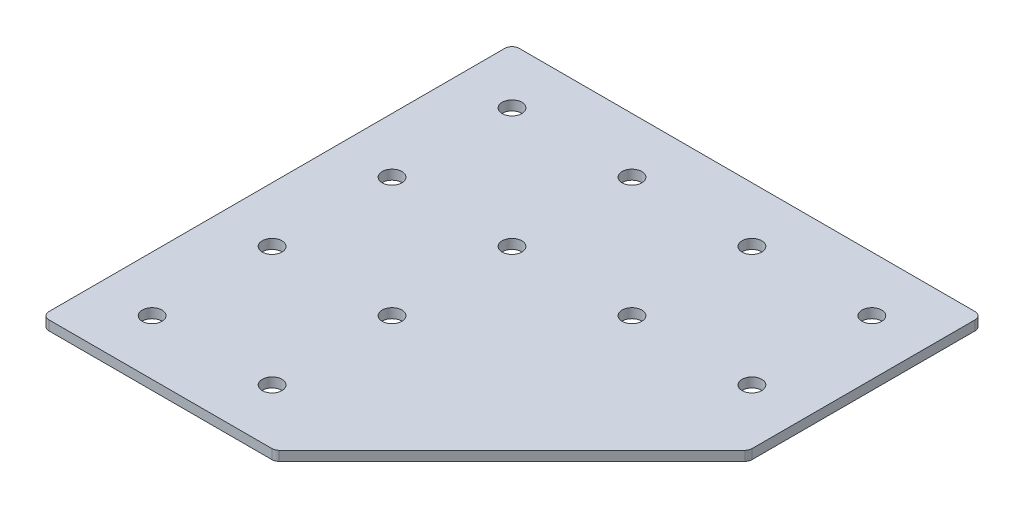
ISO-10303-21;
HEADER;
FILE_DESCRIPTION(('STEP AP214'),'2;1');
FILE_NAME('part.step','',(''),(''),'','','');
FILE_SCHEMA(('AUTOMOTIVE_DESIGN { 1 0 10303 214 1 1 1 1 }'));
ENDSEC;
DATA;
#1=APPLICATION_CONTEXT('core data for automotive mechanical design processes');
#2=APPLICATION_PROTOCOL_DEFINITION('international standard','automotive_design',2000,#1);
#3=PRODUCT_CONTEXT('',#1,'mechanical');
#4=PRODUCT('Part','Part','',(#3));
#5=PRODUCT_RELATED_PRODUCT_CATEGORY('part','',(#4));
#6=PRODUCT_DEFINITION_FORMATION('','',#4);
#7=PRODUCT_DEFINITION_CONTEXT('part definition',#1,'design');
#8=PRODUCT_DEFINITION('design','',#6,#7);
#9=PRODUCT_DEFINITION_SHAPE('','',#8);
#10=(LENGTH_UNIT() NAMED_UNIT(*) SI_UNIT(.MILLI.,.METRE.));
#11=(NAMED_UNIT(*) PLANE_ANGLE_UNIT() SI_UNIT($,.RADIAN.));
#12=(NAMED_UNIT(*) SI_UNIT($,.STERADIAN.) SOLID_ANGLE_UNIT());
#13=UNCERTAINTY_MEASURE_WITH_UNIT(LENGTH_MEASURE(1.E-05),#10,'distance_accuracy_value','');
#14=(GEOMETRIC_REPRESENTATION_CONTEXT(3) GLOBAL_UNCERTAINTY_ASSIGNED_CONTEXT((#13)) GLOBAL_UNIT_ASSIGNED_CONTEXT((#10,
#11,#12)) REPRESENTATION_CONTEXT('',''));
#15=CARTESIAN_POINT('',(0.,0.,0.));
#16=DIRECTION('',(0.,0.,1.));
#17=DIRECTION('',(1.,0.,0.));
#18=AXIS2_PLACEMENT_3D('',#15,#16,#17);
#19=CARTESIAN_POINT('',(-51.3742099073396,0.924626277206244,-51.5499410746997));
#20=DIRECTION('',(0.,-1.,0.));
#21=DIRECTION('',(0.,0.,-1.));
#22=AXIS2_PLACEMENT_3D('',#19,#20,#21);
#23=PLANE('',#22);
#24=CARTESIAN_POINT('',(73.6257900926604,0.924626277206244,-26.5499410746997));
#25=DIRECTION('',(0.,1.,0.));
#26=DIRECTION('',(0.,0.,1.));
#27=AXIS2_PLACEMENT_3D('',#24,#25,#26);
#28=CIRCLE('',#27,4.1);
#29=CARTESIAN_POINT('',(73.6257900926604,0.924626277206244,-22.4499410746997));
#30=VERTEX_POINT('',#29);
#31=EDGE_CURVE('E275',#30,#30,#28,.T.);
#32=ORIENTED_EDGE('',*,*,#31,.T.);
#33=EDGE_LOOP('',(#32));
#34=FACE_BOUND('',#33,.T.);
#35=CARTESIAN_POINT('',(23.6257900926604,0.924626277206244,-26.5499410746997));
#36=DIRECTION('',(0.,1.,0.));
#37=DIRECTION('',(0.,0.,1.));
#38=AXIS2_PLACEMENT_3D('',#35,#36,#37);
#39=CIRCLE('',#38,4.09999999999999);
#40=CARTESIAN_POINT('',(23.6257900926604,0.924626277206244,-22.4499410746997));
#41=VERTEX_POINT('',#40);
#42=EDGE_CURVE('E283',#41,#41,#39,.T.);
#43=ORIENTED_EDGE('',*,*,#42,.T.);
#44=EDGE_LOOP('',(#43));
#45=FACE_BOUND('',#44,.T.);
#46=CARTESIAN_POINT('',(-26.3742099073396,0.924626277206244,73.4500589253003));
#47=DIRECTION('',(0.,1.,0.));
#48=DIRECTION('',(0.,0.,1.));
#49=AXIS2_PLACEMENT_3D('',#46,#47,#48);
#50=CIRCLE('',#49,4.10000000000001);
#51=CARTESIAN_POINT('',(-26.3742099073396,0.924626277206244,77.5500589253003));
#52=VERTEX_POINT('',#51);
#53=EDGE_CURVE('E289',#52,#52,#50,.T.);
#54=ORIENTED_EDGE('',*,*,#53,.T.);
#55=EDGE_LOOP('',(#54));
#56=FACE_BOUND('',#55,.T.);
#57=CARTESIAN_POINT('',(-76.3742099073396,0.924626277206244,73.4500589253003));
#58=DIRECTION('',(0.,1.,0.));
#59=DIRECTION('',(0.,0.,1.));
#60=AXIS2_PLACEMENT_3D('',#57,#58,#59);
#61=CIRCLE('',#60,4.10000000000001);
#62=CARTESIAN_POINT('',(-76.3742099073396,0.924626277206244,77.5500589253003));
#63=VERTEX_POINT('',#62);
#64=EDGE_CURVE('E295',#63,#63,#61,.T.);
#65=ORIENTED_EDGE('',*,*,#64,.T.);
#66=EDGE_LOOP('',(#65));
#67=FACE_BOUND('',#66,.T.);
#68=CARTESIAN_POINT('',(-26.3742099073396,0.924626277206244,23.4500589253003));
#69=DIRECTION('',(0.,1.,0.));
#70=DIRECTION('',(0.,0.,1.));
#71=AXIS2_PLACEMENT_3D('',#68,#69,#70);
#72=CIRCLE('',#71,4.10000000000001);
#73=CARTESIAN_POINT('',(-26.3742099073396,0.924626277206244,27.5500589253003));
#74=VERTEX_POINT('',#73);
#75=EDGE_CURVE('E301',#74,#74,#72,.T.);
#76=ORIENTED_EDGE('',*,*,#75,.T.);
#77=EDGE_LOOP('',(#76));
#78=FACE_BOUND('',#77,.T.);
#79=CARTESIAN_POINT('',(-76.3742099073396,0.924626277206244,23.4500589253003));
#80=DIRECTION('',(0.,1.,0.));
#81=DIRECTION('',(0.,0.,1.));
#82=AXIS2_PLACEMENT_3D('',#79,#80,#81);
#83=CIRCLE('',#82,4.10000000000001);
#84=CARTESIAN_POINT('',(-76.3742099073396,0.924626277206244,27.5500589253003));
#85=VERTEX_POINT('',#84);
#86=EDGE_CURVE('E307',#85,#85,#83,.T.);
#87=ORIENTED_EDGE('',*,*,#86,.T.);
#88=EDGE_LOOP('',(#87));
#89=FACE_BOUND('',#88,.T.);
#90=CARTESIAN_POINT('',(-26.3742099073396,0.924626277206244,-26.5499410746997));
#91=DIRECTION('',(0.,1.,0.));
#92=DIRECTION('',(0.,0.,1.));
#93=AXIS2_PLACEMENT_3D('',#90,#91,#92);
#94=CIRCLE('',#93,4.1);
#95=CARTESIAN_POINT('',(-26.3742099073396,0.924626277206244,-22.4499410746997));
#96=VERTEX_POINT('',#95);
#97=EDGE_CURVE('E313',#96,#96,#94,.T.);
#98=ORIENTED_EDGE('',*,*,#97,.T.);
#99=EDGE_LOOP('',(#98));
#100=FACE_BOUND('',#99,.T.);
#101=CARTESIAN_POINT('',(-76.3742099073396,0.924626277206244,-26.5499410746997));
#102=DIRECTION('',(0.,1.,0.));
#103=DIRECTION('',(0.,0.,1.));
#104=AXIS2_PLACEMENT_3D('',#101,#102,#103);
#105=CIRCLE('',#104,4.1);
#106=CARTESIAN_POINT('',(-76.3742099073396,0.924626277206244,-22.4499410746997));
#107=VERTEX_POINT('',#106);
#108=EDGE_CURVE('E319',#107,#107,#105,.T.);
#109=ORIENTED_EDGE('',*,*,#108,.T.);
#110=EDGE_LOOP('',(#109));
#111=FACE_BOUND('',#110,.T.);
#112=CARTESIAN_POINT('',(73.6257900926604,0.924626277206244,-76.5499410746997));
#113=DIRECTION('',(0.,1.,0.));
#114=DIRECTION('',(0.,0.,1.));
#115=AXIS2_PLACEMENT_3D('',#112,#113,#114);
#116=CIRCLE('',#115,4.09999999999999);
#117=CARTESIAN_POINT('',(73.6257900926604,0.924626277206244,-72.4499410746997));
#118=VERTEX_POINT('',#117);
#119=EDGE_CURVE('E325',#118,#118,#116,.T.);
#120=ORIENTED_EDGE('',*,*,#119,.T.);
#121=EDGE_LOOP('',(#120));
#122=FACE_BOUND('',#121,.T.);
#123=CARTESIAN_POINT('',(23.6257900926604,0.924626277206244,-76.5499410746997));
#124=DIRECTION('',(0.,1.,0.));
#125=DIRECTION('',(0.,0.,1.));
#126=AXIS2_PLACEMENT_3D('',#123,#124,#125);
#127=CIRCLE('',#126,4.09999999999999);
#128=CARTESIAN_POINT('',(23.6257900926604,0.924626277206244,-72.4499410746997));
#129=VERTEX_POINT('',#128);
#130=EDGE_CURVE('E331',#129,#129,#127,.T.);
#131=ORIENTED_EDGE('',*,*,#130,.T.);
#132=EDGE_LOOP('',(#131));
#133=FACE_BOUND('',#132,.T.);
#134=CARTESIAN_POINT('',(-26.3742099073396,0.924626277206244,-76.5499410746997));
#135=DIRECTION('',(0.,1.,0.));
#136=DIRECTION('',(0.,0.,1.));
#137=AXIS2_PLACEMENT_3D('',#134,#135,#136);
#138=CIRCLE('',#137,4.1);
#139=CARTESIAN_POINT('',(-26.3742099073396,0.924626277206244,-72.4499410746997));
#140=VERTEX_POINT('',#139);
#141=EDGE_CURVE('E337',#140,#140,#138,.T.);
#142=ORIENTED_EDGE('',*,*,#141,.T.);
#143=EDGE_LOOP('',(#142));
#144=FACE_BOUND('',#143,.T.);
#145=CARTESIAN_POINT('',(-76.3742099073396,0.924626277206244,-76.5499410746997));
#146=DIRECTION('',(0.,1.,0.));
#147=DIRECTION('',(0.,0.,1.));
#148=AXIS2_PLACEMENT_3D('',#145,#146,#147);
#149=CIRCLE('',#148,4.1);
#150=CARTESIAN_POINT('',(-76.3742099073396,0.924626277206244,-72.4499410746997));
#151=VERTEX_POINT('',#150);
#152=EDGE_CURVE('E175',#151,#151,#149,.T.);
#153=ORIENTED_EDGE('',*,*,#152,.T.);
#154=EDGE_LOOP('',(#153));
#155=FACE_BOUND('',#154,.T.);
#156=DIRECTION('',(1.,0.,0.));
#157=VECTOR('',#156,1.);
#158=CARTESIAN_POINT('',(-99.3742099073397,0.924626277206244,96.4500589253003));
#159=LINE('',#158,#157);
#160=CARTESIAN_POINT('',(-96.3742099073397,0.924626277206244,96.4500589253003));
#161=VERTEX_POINT('',#160);
#162=CARTESIAN_POINT('',(-3.44527771920494,0.924626277206244,96.4500589253002));
#163=VERTEX_POINT('',#162);
#164=EDGE_CURVE('E121',#161,#163,#159,.T.);
#165=ORIENTED_EDGE('',*,*,#164,.F.);
#166=CARTESIAN_POINT('',(-96.3742099073397,0.924626277206244,93.4500589253003));
#167=DIRECTION('',(0.,-1.,0.));
#168=DIRECTION('',(0.,0.,-1.));
#169=AXIS2_PLACEMENT_3D('',#166,#167,#168);
#170=CIRCLE('',#169,3.);
#171=CARTESIAN_POINT('',(-99.3742099073397,0.924626277206244,93.4500589253003));
#172=VERTEX_POINT('',#171);
#173=EDGE_CURVE('E145',#161,#172,#170,.T.);
#174=ORIENTED_EDGE('',*,*,#173,.T.);
#175=DIRECTION('',(0.,0.,1.));
#176=VECTOR('',#175,1.);
#177=CARTESIAN_POINT('',(-99.3742099073397,0.924626277206244,-99.5499410746997));
#178=LINE('',#177,#176);
#179=CARTESIAN_POINT('',(-99.3742099073397,0.924626277206244,-96.5499410746997));
#180=VERTEX_POINT('',#179);
#181=EDGE_CURVE('E162',#180,#172,#178,.T.);
#182=ORIENTED_EDGE('',*,*,#181,.F.);
#183=CARTESIAN_POINT('',(-96.3742099073397,0.924626277206244,-96.5499410746997));
#184=DIRECTION('',(0.,-1.,0.));
#185=DIRECTION('',(0.,0.,-1.));
#186=AXIS2_PLACEMENT_3D('',#183,#184,#185);
#187=CIRCLE('',#186,3.);
#188=CARTESIAN_POINT('',(-96.3742099073397,0.924626277206244,-99.5499410746997));
#189=VERTEX_POINT('',#188);
#190=EDGE_CURVE('E117',#180,#189,#187,.T.);
#191=ORIENTED_EDGE('',*,*,#190,.T.);
#192=DIRECTION('',(-1.,0.,0.));
#193=VECTOR('',#192,1.);
#194=CARTESIAN_POINT('',(96.6257900926603,0.924626277206244,-99.5499410746997));
#195=LINE('',#194,#193);
#196=CARTESIAN_POINT('',(93.6257900926603,0.924626277206244,-99.5499410746997));
#197=VERTEX_POINT('',#196);
#198=EDGE_CURVE('E160',#197,#189,#195,.T.);
#199=ORIENTED_EDGE('',*,*,#198,.F.);
#200=CARTESIAN_POINT('',(93.6257900926603,0.924626277206244,-96.5499410746998));
#201=DIRECTION('',(0.,-1.,0.));
#202=DIRECTION('',(0.,0.,-1.));
#203=AXIS2_PLACEMENT_3D('',#200,#201,#202);
#204=CIRCLE('',#203,3.);
#205=CARTESIAN_POINT('',(96.6257900926603,0.924626277206244,-96.5499410746997));
#206=VERTEX_POINT('',#205);
#207=EDGE_CURVE('E140',#197,#206,#204,.T.);
#208=ORIENTED_EDGE('',*,*,#207,.T.);
#209=DIRECTION('',(0.,0.,-1.));
#210=VECTOR('',#209,1.);
#211=CARTESIAN_POINT('',(96.6257900926603,0.924626277206244,-2.3783681994458));
#212=LINE('',#211,#210);
#213=CARTESIAN_POINT('',(96.6257900926603,0.924626277206244,-3.62100888656507));
#214=VERTEX_POINT('',#213);
#215=EDGE_CURVE('E163',#214,#206,#212,.T.);
#216=ORIENTED_EDGE('',*,*,#215,.F.);
#217=CARTESIAN_POINT('',(93.6257900926603,0.924626277206244,-3.62100888656507));
#218=DIRECTION('',(0.,-1.,0.));
#219=DIRECTION('',(0.,0.,-1.));
#220=AXIS2_PLACEMENT_3D('',#217,#218,#219);
#221=CIRCLE('',#220,3.);
#222=CARTESIAN_POINT('',(95.7471104362199,0.924626277206244,-1.49968854300543));
#223=VERTEX_POINT('',#222);
#224=EDGE_CURVE('E31',#214,#223,#221,.T.);
#225=ORIENTED_EDGE('',*,*,#224,.T.);
#226=DIRECTION('',(0.707106781186547,0.,-0.707106781186548));
#227=VECTOR('',#226,1.);
#228=CARTESIAN_POINT('',(-2.20263703208567,0.924626277206244,96.4500589253002));
#229=LINE('',#228,#227);
#230=CARTESIAN_POINT('',(-1.3239573756453,0.924626277206244,95.5713792688599));
#231=VERTEX_POINT('',#230);
#232=EDGE_CURVE('E118',#231,#223,#229,.T.);
#233=ORIENTED_EDGE('',*,*,#232,.F.);
#234=CARTESIAN_POINT('',(-3.44527771920494,0.924626277206244,93.4500589253002));
#235=DIRECTION('',(0.,-1.,0.));
#236=DIRECTION('',(0.,0.,-1.));
#237=AXIS2_PLACEMENT_3D('',#234,#235,#236);
#238=CIRCLE('',#237,3.);
#239=EDGE_CURVE('E143',#231,#163,#238,.T.);
#240=ORIENTED_EDGE('',*,*,#239,.T.);
#241=EDGE_LOOP('',(#165,#174,#182,#191,#199,#208,#216,#225,#233,#240));
#242=FACE_BOUND('',#241,.T.);
#243=ADVANCED_FACE('F16',(#34,#45,#56,#67,#78,#89,#100,#111,#122,#133,#144,#155,#242),#23,.T.);
#244=CARTESIAN_POINT('',(96.6257900926603,0.924626277206244,-2.3783681994458));
#245=DIRECTION('',(1.,0.,0.));
#246=DIRECTION('',(0.,0.,-1.));
#247=AXIS2_PLACEMENT_3D('',#244,#245,#246);
#248=PLANE('',#247);
#249=DIRECTION('',(0.,0.,-1.));
#250=VECTOR('',#249,1.);
#251=CARTESIAN_POINT('',(96.6257900926603,4.92462627720624,-2.3783681994458));
#252=LINE('',#251,#250);
#253=CARTESIAN_POINT('',(96.6257900926603,4.92462627720624,-3.62100888656507));
#254=VERTEX_POINT('',#253);
#255=CARTESIAN_POINT('',(96.6257900926603,4.92462627720624,-96.5499410746997));
#256=VERTEX_POINT('',#255);
#257=EDGE_CURVE('E172',#254,#256,#252,.T.);
#258=ORIENTED_EDGE('',*,*,#257,.F.);
#259=DIRECTION('',(0.,1.,0.));
#260=VECTOR('',#259,1.);
#261=CARTESIAN_POINT('',(96.6257900926603,0.924626277206244,-3.62100888656507));
#262=LINE('',#261,#260);
#263=EDGE_CURVE('E154',#254,#214,#262,.F.);
#264=ORIENTED_EDGE('',*,*,#263,.T.);
#265=ORIENTED_EDGE('',*,*,#215,.T.);
#266=DIRECTION('',(0.,1.,0.));
#267=VECTOR('',#266,1.);
#268=CARTESIAN_POINT('',(96.6257900926603,0.924626277206244,-96.5499410746998));
#269=LINE('',#268,#267);
#270=EDGE_CURVE('E151',#206,#256,#269,.T.);
#271=ORIENTED_EDGE('',*,*,#270,.T.);
#272=EDGE_LOOP('',(#258,#264,#265,#271));
#273=FACE_BOUND('',#272,.T.);
#274=ADVANCED_FACE('F206',(#273),#248,.T.);
#275=CARTESIAN_POINT('',(-2.20263703208567,0.924626277206244,96.4500589253002));
#276=DIRECTION('',(0.707106781186548,0.,0.707106781186547));
#277=DIRECTION('',(0.707106781186547,0.,-0.707106781186548));
#278=AXIS2_PLACEMENT_3D('',#275,#276,#277);
#279=PLANE('',#278);
#280=DIRECTION('',(0.707106781186547,0.,-0.707106781186548));
#281=VECTOR('',#280,1.);
#282=CARTESIAN_POINT('',(-2.20263703208567,4.92462627720624,96.4500589253002));
#283=LINE('',#282,#281);
#284=CARTESIAN_POINT('',(-1.3239573756453,4.92462627720624,95.5713792688599));
#285=VERTEX_POINT('',#284);
#286=CARTESIAN_POINT('',(95.7471104362199,4.92462627720624,-1.49968854300543));
#287=VERTEX_POINT('',#286);
#288=EDGE_CURVE('E124',#285,#287,#283,.T.);
#289=ORIENTED_EDGE('',*,*,#288,.F.);
#290=DIRECTION('',(0.,1.,0.));
#291=VECTOR('',#290,1.);
#292=CARTESIAN_POINT('',(-1.3239573756453,0.924626277206244,95.5713792688599));
#293=LINE('',#292,#291);
#294=EDGE_CURVE('E38',#285,#231,#293,.F.);
#295=ORIENTED_EDGE('',*,*,#294,.T.);
#296=ORIENTED_EDGE('',*,*,#232,.T.);
#297=DIRECTION('',(0.,1.,0.));
#298=VECTOR('',#297,1.);
#299=CARTESIAN_POINT('',(95.7471104362199,0.924626277206244,-1.49968854300542));
#300=LINE('',#299,#298);
#301=EDGE_CURVE('E147',#223,#287,#300,.T.);
#302=ORIENTED_EDGE('',*,*,#301,.T.);
#303=EDGE_LOOP('',(#289,#295,#296,#302));
#304=FACE_BOUND('',#303,.T.);
#305=ADVANCED_FACE('F180',(#304),#279,.T.);
#306=CARTESIAN_POINT('',(-99.3742099073397,0.924626277206244,96.4500589253003));
#307=DIRECTION('',(0.,0.,1.));
#308=DIRECTION('',(1.,0.,0.));
#309=AXIS2_PLACEMENT_3D('',#306,#307,#308);
#310=PLANE('',#309);
#311=DIRECTION('',(1.,0.,0.));
#312=VECTOR('',#311,1.);
#313=CARTESIAN_POINT('',(-99.3742099073397,4.92462627720624,96.4500589253003));
#314=LINE('',#313,#312);
#315=CARTESIAN_POINT('',(-96.3742099073397,4.92462627720624,96.4500589253003));
#316=VERTEX_POINT('',#315);
#317=CARTESIAN_POINT('',(-3.44527771920494,4.92462627720624,96.4500589253002));
#318=VERTEX_POINT('',#317);
#319=EDGE_CURVE('E114',#316,#318,#314,.T.);
#320=ORIENTED_EDGE('',*,*,#319,.F.);
#321=DIRECTION('',(0.,1.,0.));
#322=VECTOR('',#321,1.);
#323=CARTESIAN_POINT('',(-96.3742099073397,0.924626277206244,96.4500589253003));
#324=LINE('',#323,#322);
#325=EDGE_CURVE('E137',#316,#161,#324,.F.);
#326=ORIENTED_EDGE('',*,*,#325,.T.);
#327=ORIENTED_EDGE('',*,*,#164,.T.);
#328=DIRECTION('',(0.,1.,0.));
#329=VECTOR('',#328,1.);
#330=CARTESIAN_POINT('',(-3.44527771920494,0.924626277206244,96.4500589253002));
#331=LINE('',#330,#329);
#332=EDGE_CURVE('E134',#163,#318,#331,.T.);
#333=ORIENTED_EDGE('',*,*,#332,.T.);
#334=EDGE_LOOP('',(#320,#326,#327,#333));
#335=FACE_BOUND('',#334,.T.);
#336=ADVANCED_FACE('F189',(#335),#310,.T.);
#337=CARTESIAN_POINT('',(-99.3742099073397,0.924626277206244,-99.5499410746997));
#338=DIRECTION('',(-1.,0.,0.));
#339=DIRECTION('',(0.,0.,1.));
#340=AXIS2_PLACEMENT_3D('',#337,#338,#339);
#341=PLANE('',#340);
#342=ORIENTED_EDGE('',*,*,#181,.T.);
#343=DIRECTION('',(0.,1.,0.));
#344=VECTOR('',#343,1.);
#345=CARTESIAN_POINT('',(-99.3742099073397,0.924626277206244,93.4500589253003));
#346=LINE('',#345,#344);
#347=CARTESIAN_POINT('',(-99.3742099073397,4.92462627720624,93.4500589253003));
#348=VERTEX_POINT('',#347);
#349=EDGE_CURVE('E105',#172,#348,#346,.T.);
#350=ORIENTED_EDGE('',*,*,#349,.T.);
#351=DIRECTION('',(0.,0.,1.));
#352=VECTOR('',#351,1.);
#353=CARTESIAN_POINT('',(-99.3742099073397,4.92462627720624,-99.5499410746997));
#354=LINE('',#353,#352);
#355=CARTESIAN_POINT('',(-99.3742099073397,4.92462627720624,-96.5499410746997));
#356=VERTEX_POINT('',#355);
#357=EDGE_CURVE('E97',#356,#348,#354,.T.);
#358=ORIENTED_EDGE('',*,*,#357,.F.);
#359=DIRECTION('',(0.,1.,0.));
#360=VECTOR('',#359,1.);
#361=CARTESIAN_POINT('',(-99.3742099073397,0.924626277206244,-96.5499410746997));
#362=LINE('',#361,#360);
#363=EDGE_CURVE('E111',#356,#180,#362,.F.);
#364=ORIENTED_EDGE('',*,*,#363,.T.);
#365=EDGE_LOOP('',(#342,#350,#358,#364));
#366=FACE_BOUND('',#365,.T.);
#367=ADVANCED_FACE('F110',(#366),#341,.T.);
#368=CARTESIAN_POINT('',(96.6257900926603,0.924626277206244,-99.5499410746997));
#369=DIRECTION('',(0.,0.,-1.));
#370=DIRECTION('',(-1.,0.,0.));
#371=AXIS2_PLACEMENT_3D('',#368,#369,#370);
#372=PLANE('',#371);
#373=DIRECTION('',(-1.,0.,0.));
#374=VECTOR('',#373,1.);
#375=CARTESIAN_POINT('',(96.6257900926603,4.92462627720624,-99.5499410746997));
#376=LINE('',#375,#374);
#377=CARTESIAN_POINT('',(93.6257900926603,4.92462627720624,-99.5499410746997));
#378=VERTEX_POINT('',#377);
#379=CARTESIAN_POINT('',(-96.3742099073397,4.92462627720624,-99.5499410746997));
#380=VERTEX_POINT('',#379);
#381=EDGE_CURVE('E99',#378,#380,#376,.T.);
#382=ORIENTED_EDGE('',*,*,#381,.F.);
#383=DIRECTION('',(0.,1.,0.));
#384=VECTOR('',#383,1.);
#385=CARTESIAN_POINT('',(93.6257900926603,0.924626277206244,-99.5499410746997));
#386=LINE('',#385,#384);
#387=EDGE_CURVE('E10',#378,#197,#386,.F.);
#388=ORIENTED_EDGE('',*,*,#387,.T.);
#389=ORIENTED_EDGE('',*,*,#198,.T.);
#390=DIRECTION('',(0.,1.,0.));
#391=VECTOR('',#390,1.);
#392=CARTESIAN_POINT('',(-96.3742099073397,0.924626277206244,-99.5499410746997));
#393=LINE('',#392,#391);
#394=EDGE_CURVE('E24',#189,#380,#393,.T.);
#395=ORIENTED_EDGE('',*,*,#394,.T.);
#396=EDGE_LOOP('',(#382,#388,#389,#395));
#397=FACE_BOUND('',#396,.T.);
#398=ADVANCED_FACE('F157',(#397),#372,.T.);
#399=CARTESIAN_POINT('',(-51.3742099073396,4.92462627720624,-51.5499410746997));
#400=DIRECTION('',(0.,-1.,0.));
#401=DIRECTION('',(0.,0.,-1.));
#402=AXIS2_PLACEMENT_3D('',#399,#400,#401);
#403=PLANE('',#402);
#404=CARTESIAN_POINT('',(73.6257900926604,4.92462627720624,-26.5499410746997));
#405=DIRECTION('',(0.,1.,0.));
#406=DIRECTION('',(0.,0.,1.));
#407=AXIS2_PLACEMENT_3D('',#404,#405,#406);
#408=CIRCLE('',#407,4.1);
#409=CARTESIAN_POINT('',(73.6257900926604,4.92462627720624,-22.4499410746997));
#410=VERTEX_POINT('',#409);
#411=EDGE_CURVE('E278',#410,#410,#408,.T.);
#412=ORIENTED_EDGE('',*,*,#411,.F.);
#413=EDGE_LOOP('',(#412));
#414=FACE_BOUND('',#413,.T.);
#415=CARTESIAN_POINT('',(23.6257900926604,4.92462627720624,-26.5499410746997));
#416=DIRECTION('',(0.,1.,0.));
#417=DIRECTION('',(0.,0.,1.));
#418=AXIS2_PLACEMENT_3D('',#415,#416,#417);
#419=CIRCLE('',#418,4.09999999999999);
#420=CARTESIAN_POINT('',(23.6257900926604,4.92462627720624,-22.4499410746997));
#421=VERTEX_POINT('',#420);
#422=EDGE_CURVE('E280',#421,#421,#419,.T.);
#423=ORIENTED_EDGE('',*,*,#422,.F.);
#424=EDGE_LOOP('',(#423));
#425=FACE_BOUND('',#424,.T.);
#426=CARTESIAN_POINT('',(-26.3742099073396,4.92462627720624,73.4500589253003));
#427=DIRECTION('',(0.,1.,0.));
#428=DIRECTION('',(0.,0.,1.));
#429=AXIS2_PLACEMENT_3D('',#426,#427,#428);
#430=CIRCLE('',#429,4.10000000000001);
#431=CARTESIAN_POINT('',(-26.3742099073396,4.92462627720624,77.5500589253003));
#432=VERTEX_POINT('',#431);
#433=EDGE_CURVE('E286',#432,#432,#430,.T.);
#434=ORIENTED_EDGE('',*,*,#433,.F.);
#435=EDGE_LOOP('',(#434));
#436=FACE_BOUND('',#435,.T.);
#437=CARTESIAN_POINT('',(-76.3742099073396,4.92462627720624,73.4500589253003));
#438=DIRECTION('',(0.,1.,0.));
#439=DIRECTION('',(0.,0.,1.));
#440=AXIS2_PLACEMENT_3D('',#437,#438,#439);
#441=CIRCLE('',#440,4.10000000000001);
#442=CARTESIAN_POINT('',(-76.3742099073396,4.92462627720624,77.5500589253003));
#443=VERTEX_POINT('',#442);
#444=EDGE_CURVE('E292',#443,#443,#441,.T.);
#445=ORIENTED_EDGE('',*,*,#444,.F.);
#446=EDGE_LOOP('',(#445));
#447=FACE_BOUND('',#446,.T.);
#448=CARTESIAN_POINT('',(-26.3742099073396,4.92462627720624,23.4500589253003));
#449=DIRECTION('',(0.,1.,0.));
#450=DIRECTION('',(0.,0.,1.));
#451=AXIS2_PLACEMENT_3D('',#448,#449,#450);
#452=CIRCLE('',#451,4.10000000000001);
#453=CARTESIAN_POINT('',(-26.3742099073396,4.92462627720624,27.5500589253003));
#454=VERTEX_POINT('',#453);
#455=EDGE_CURVE('E298',#454,#454,#452,.T.);
#456=ORIENTED_EDGE('',*,*,#455,.F.);
#457=EDGE_LOOP('',(#456));
#458=FACE_BOUND('',#457,.T.);
#459=CARTESIAN_POINT('',(-76.3742099073396,4.92462627720624,23.4500589253003));
#460=DIRECTION('',(0.,1.,0.));
#461=DIRECTION('',(0.,0.,1.));
#462=AXIS2_PLACEMENT_3D('',#459,#460,#461);
#463=CIRCLE('',#462,4.10000000000001);
#464=CARTESIAN_POINT('',(-76.3742099073396,4.92462627720624,27.5500589253003));
#465=VERTEX_POINT('',#464);
#466=EDGE_CURVE('E304',#465,#465,#463,.T.);
#467=ORIENTED_EDGE('',*,*,#466,.F.);
#468=EDGE_LOOP('',(#467));
#469=FACE_BOUND('',#468,.T.);
#470=CARTESIAN_POINT('',(-26.3742099073396,4.92462627720624,-26.5499410746997));
#471=DIRECTION('',(0.,1.,0.));
#472=DIRECTION('',(0.,0.,1.));
#473=AXIS2_PLACEMENT_3D('',#470,#471,#472);
#474=CIRCLE('',#473,4.1);
#475=CARTESIAN_POINT('',(-26.3742099073396,4.92462627720624,-22.4499410746997));
#476=VERTEX_POINT('',#475);
#477=EDGE_CURVE('E310',#476,#476,#474,.T.);
#478=ORIENTED_EDGE('',*,*,#477,.F.);
#479=EDGE_LOOP('',(#478));
#480=FACE_BOUND('',#479,.T.);
#481=CARTESIAN_POINT('',(-76.3742099073396,4.92462627720624,-26.5499410746997));
#482=DIRECTION('',(0.,1.,0.));
#483=DIRECTION('',(0.,0.,1.));
#484=AXIS2_PLACEMENT_3D('',#481,#482,#483);
#485=CIRCLE('',#484,4.1);
#486=CARTESIAN_POINT('',(-76.3742099073396,4.92462627720624,-22.4499410746997));
#487=VERTEX_POINT('',#486);
#488=EDGE_CURVE('E316',#487,#487,#485,.T.);
#489=ORIENTED_EDGE('',*,*,#488,.F.);
#490=EDGE_LOOP('',(#489));
#491=FACE_BOUND('',#490,.T.);
#492=CARTESIAN_POINT('',(73.6257900926604,4.92462627720624,-76.5499410746997));
#493=DIRECTION('',(0.,1.,0.));
#494=DIRECTION('',(0.,0.,1.));
#495=AXIS2_PLACEMENT_3D('',#492,#493,#494);
#496=CIRCLE('',#495,4.09999999999999);
#497=CARTESIAN_POINT('',(73.6257900926604,4.92462627720624,-72.4499410746997));
#498=VERTEX_POINT('',#497);
#499=EDGE_CURVE('E322',#498,#498,#496,.T.);
#500=ORIENTED_EDGE('',*,*,#499,.F.);
#501=EDGE_LOOP('',(#500));
#502=FACE_BOUND('',#501,.T.);
#503=CARTESIAN_POINT('',(23.6257900926604,4.92462627720624,-76.5499410746997));
#504=DIRECTION('',(0.,1.,0.));
#505=DIRECTION('',(0.,0.,1.));
#506=AXIS2_PLACEMENT_3D('',#503,#504,#505);
#507=CIRCLE('',#506,4.09999999999999);
#508=CARTESIAN_POINT('',(23.6257900926604,4.92462627720624,-72.4499410746997));
#509=VERTEX_POINT('',#508);
#510=EDGE_CURVE('E328',#509,#509,#507,.T.);
#511=ORIENTED_EDGE('',*,*,#510,.F.);
#512=EDGE_LOOP('',(#511));
#513=FACE_BOUND('',#512,.T.);
#514=CARTESIAN_POINT('',(-26.3742099073396,4.92462627720624,-76.5499410746997));
#515=DIRECTION('',(0.,1.,0.));
#516=DIRECTION('',(0.,0.,1.));
#517=AXIS2_PLACEMENT_3D('',#514,#515,#516);
#518=CIRCLE('',#517,4.1);
#519=CARTESIAN_POINT('',(-26.3742099073396,4.92462627720624,-72.4499410746997));
#520=VERTEX_POINT('',#519);
#521=EDGE_CURVE('E334',#520,#520,#518,.T.);
#522=ORIENTED_EDGE('',*,*,#521,.F.);
#523=EDGE_LOOP('',(#522));
#524=FACE_BOUND('',#523,.T.);
#525=CARTESIAN_POINT('',(-76.3742099073396,4.92462627720624,-76.5499410746997));
#526=DIRECTION('',(0.,1.,0.));
#527=DIRECTION('',(0.,0.,1.));
#528=AXIS2_PLACEMENT_3D('',#525,#526,#527);
#529=CIRCLE('',#528,4.1);
#530=CARTESIAN_POINT('',(-76.3742099073396,4.92462627720624,-72.4499410746997));
#531=VERTEX_POINT('',#530);
#532=EDGE_CURVE('E340',#531,#531,#529,.T.);
#533=ORIENTED_EDGE('',*,*,#532,.F.);
#534=EDGE_LOOP('',(#533));
#535=FACE_BOUND('',#534,.T.);
#536=ORIENTED_EDGE('',*,*,#357,.T.);
#537=CARTESIAN_POINT('',(-96.3742099073397,4.92462627720624,93.4500589253003));
#538=DIRECTION('',(0.,-1.,0.));
#539=DIRECTION('',(0.,0.,-1.));
#540=AXIS2_PLACEMENT_3D('',#537,#538,#539);
#541=CIRCLE('',#540,3.);
#542=EDGE_CURVE('E132',#348,#316,#541,.F.);
#543=ORIENTED_EDGE('',*,*,#542,.T.);
#544=ORIENTED_EDGE('',*,*,#319,.T.);
#545=CARTESIAN_POINT('',(-3.44527771920494,4.92462627720624,93.4500589253002));
#546=DIRECTION('',(0.,-1.,0.));
#547=DIRECTION('',(0.,0.,-1.));
#548=AXIS2_PLACEMENT_3D('',#545,#546,#547);
#549=CIRCLE('',#548,3.);
#550=EDGE_CURVE('E130',#318,#285,#549,.F.);
#551=ORIENTED_EDGE('',*,*,#550,.T.);
#552=ORIENTED_EDGE('',*,*,#288,.T.);
#553=CARTESIAN_POINT('',(93.6257900926603,4.92462627720624,-3.62100888656507));
#554=DIRECTION('',(0.,-1.,0.));
#555=DIRECTION('',(0.,0.,-1.));
#556=AXIS2_PLACEMENT_3D('',#553,#554,#555);
#557=CIRCLE('',#556,3.);
#558=EDGE_CURVE('E128',#287,#254,#557,.F.);
#559=ORIENTED_EDGE('',*,*,#558,.T.);
#560=ORIENTED_EDGE('',*,*,#257,.T.);
#561=CARTESIAN_POINT('',(93.6257900926603,4.92462627720624,-96.5499410746998));
#562=DIRECTION('',(0.,-1.,0.));
#563=DIRECTION('',(0.,0.,-1.));
#564=AXIS2_PLACEMENT_3D('',#561,#562,#563);
#565=CIRCLE('',#564,3.);
#566=EDGE_CURVE('E104',#256,#378,#565,.F.);
#567=ORIENTED_EDGE('',*,*,#566,.T.);
#568=ORIENTED_EDGE('',*,*,#381,.T.);
#569=CARTESIAN_POINT('',(-96.3742099073397,4.92462627720624,-96.5499410746997));
#570=DIRECTION('',(0.,-1.,0.));
#571=DIRECTION('',(0.,0.,-1.));
#572=AXIS2_PLACEMENT_3D('',#569,#570,#571);
#573=CIRCLE('',#572,3.);
#574=EDGE_CURVE('E94',#380,#356,#573,.F.);
#575=ORIENTED_EDGE('',*,*,#574,.T.);
#576=EDGE_LOOP('',(#536,#543,#544,#551,#552,#559,#560,#567,#568,#575));
#577=FACE_BOUND('',#576,.T.);
#578=ADVANCED_FACE('F96',(#414,#425,#436,#447,#458,#469,#480,#491,#502,#513,#524,#535,#577),
#403,.F.);
#579=CARTESIAN_POINT('',(-96.3742099073397,0.924626277206244,93.4500589253003));
#580=DIRECTION('',(0.,1.,0.));
#581=DIRECTION('',(0.,0.,1.));
#582=AXIS2_PLACEMENT_3D('',#579,#580,#581);
#583=CYLINDRICAL_SURFACE('',#582,3.);
#584=ORIENTED_EDGE('',*,*,#173,.F.);
#585=ORIENTED_EDGE('',*,*,#325,.F.);
#586=ORIENTED_EDGE('',*,*,#542,.F.);
#587=ORIENTED_EDGE('',*,*,#349,.F.);
#588=EDGE_LOOP('',(#584,#585,#586,#587));
#589=FACE_BOUND('',#588,.T.);
#590=ADVANCED_FACE('F192',(#589),#583,.T.);
#591=CARTESIAN_POINT('',(-3.44527771920494,0.924626277206244,93.4500589253002));
#592=DIRECTION('',(0.,1.,0.));
#593=DIRECTION('',(0.,0.,1.));
#594=AXIS2_PLACEMENT_3D('',#591,#592,#593);
#595=CYLINDRICAL_SURFACE('',#594,3.);
#596=ORIENTED_EDGE('',*,*,#239,.F.);
#597=ORIENTED_EDGE('',*,*,#294,.F.);
#598=ORIENTED_EDGE('',*,*,#550,.F.);
#599=ORIENTED_EDGE('',*,*,#332,.F.);
#600=EDGE_LOOP('',(#596,#597,#598,#599));
#601=FACE_BOUND('',#600,.T.);
#602=ADVANCED_FACE('F184',(#601),#595,.T.);
#603=CARTESIAN_POINT('',(93.6257900926603,0.924626277206244,-3.62100888656507));
#604=DIRECTION('',(0.,1.,0.));
#605=DIRECTION('',(0.,0.,1.));
#606=AXIS2_PLACEMENT_3D('',#603,#604,#605);
#607=CYLINDRICAL_SURFACE('',#606,3.);
#608=ORIENTED_EDGE('',*,*,#224,.F.);
#609=ORIENTED_EDGE('',*,*,#263,.F.);
#610=ORIENTED_EDGE('',*,*,#558,.F.);
#611=ORIENTED_EDGE('',*,*,#301,.F.);
#612=EDGE_LOOP('',(#608,#609,#610,#611));
#613=FACE_BOUND('',#612,.T.);
#614=ADVANCED_FACE('F200',(#613),#607,.T.);
#615=CARTESIAN_POINT('',(93.6257900926603,0.924626277206244,-96.5499410746998));
#616=DIRECTION('',(0.,1.,0.));
#617=DIRECTION('',(0.,0.,1.));
#618=AXIS2_PLACEMENT_3D('',#615,#616,#617);
#619=CYLINDRICAL_SURFACE('',#618,3.);
#620=ORIENTED_EDGE('',*,*,#207,.F.);
#621=ORIENTED_EDGE('',*,*,#387,.F.);
#622=ORIENTED_EDGE('',*,*,#566,.F.);
#623=ORIENTED_EDGE('',*,*,#270,.F.);
#624=EDGE_LOOP('',(#620,#621,#622,#623));
#625=FACE_BOUND('',#624,.T.);
#626=ADVANCED_FACE('F451',(#625),#619,.T.);
#627=CARTESIAN_POINT('',(-96.3742099073397,0.924626277206244,-96.5499410746997));
#628=DIRECTION('',(0.,1.,0.));
#629=DIRECTION('',(0.,0.,1.));
#630=AXIS2_PLACEMENT_3D('',#627,#628,#629);
#631=CYLINDRICAL_SURFACE('',#630,3.);
#632=ORIENTED_EDGE('',*,*,#190,.F.);
#633=ORIENTED_EDGE('',*,*,#363,.F.);
#634=ORIENTED_EDGE('',*,*,#574,.F.);
#635=ORIENTED_EDGE('',*,*,#394,.F.);
#636=EDGE_LOOP('',(#632,#633,#634,#635));
#637=FACE_BOUND('',#636,.T.);
#638=ADVANCED_FACE('F18',(#637),#631,.T.);
#639=CARTESIAN_POINT('',(-76.3742099073396,0.924626277206244,-76.5499410746997));
#640=DIRECTION('',(0.,1.,0.));
#641=DIRECTION('',(0.,0.,1.));
#642=AXIS2_PLACEMENT_3D('',#639,#640,#641);
#643=CYLINDRICAL_SURFACE('',#642,4.1);
#644=ORIENTED_EDGE('',*,*,#152,.F.);
#645=EDGE_LOOP('',(#644));
#646=FACE_BOUND('',#645,.T.);
#647=ORIENTED_EDGE('',*,*,#532,.T.);
#648=EDGE_LOOP('',(#647));
#649=FACE_BOUND('',#648,.T.);
#650=ADVANCED_FACE('F224',(#646,#649),#643,.F.);
#651=CARTESIAN_POINT('',(-26.3742099073396,0.924626277206244,-76.5499410746997));
#652=DIRECTION('',(0.,1.,0.));
#653=DIRECTION('',(0.,0.,1.));
#654=AXIS2_PLACEMENT_3D('',#651,#652,#653);
#655=CYLINDRICAL_SURFACE('',#654,4.1);
#656=ORIENTED_EDGE('',*,*,#141,.F.);
#657=EDGE_LOOP('',(#656));
#658=FACE_BOUND('',#657,.T.);
#659=ORIENTED_EDGE('',*,*,#521,.T.);
#660=EDGE_LOOP('',(#659));
#661=FACE_BOUND('',#660,.T.);
#662=ADVANCED_FACE('F227',(#658,#661),#655,.F.);
#663=CARTESIAN_POINT('',(23.6257900926604,0.924626277206244,-76.5499410746997));
#664=DIRECTION('',(0.,1.,0.));
#665=DIRECTION('',(0.,0.,1.));
#666=AXIS2_PLACEMENT_3D('',#663,#664,#665);
#667=CYLINDRICAL_SURFACE('',#666,4.09999999999999);
#668=ORIENTED_EDGE('',*,*,#130,.F.);
#669=EDGE_LOOP('',(#668));
#670=FACE_BOUND('',#669,.T.);
#671=ORIENTED_EDGE('',*,*,#510,.T.);
#672=EDGE_LOOP('',(#671));
#673=FACE_BOUND('',#672,.T.);
#674=ADVANCED_FACE('F231',(#670,#673),#667,.F.);
#675=CARTESIAN_POINT('',(73.6257900926604,0.924626277206244,-76.5499410746997));
#676=DIRECTION('',(0.,1.,0.));
#677=DIRECTION('',(0.,0.,1.));
#678=AXIS2_PLACEMENT_3D('',#675,#676,#677);
#679=CYLINDRICAL_SURFACE('',#678,4.09999999999999);
#680=ORIENTED_EDGE('',*,*,#119,.F.);
#681=EDGE_LOOP('',(#680));
#682=FACE_BOUND('',#681,.T.);
#683=ORIENTED_EDGE('',*,*,#499,.T.);
#684=EDGE_LOOP('',(#683));
#685=FACE_BOUND('',#684,.T.);
#686=ADVANCED_FACE('F235',(#682,#685),#679,.F.);
#687=CARTESIAN_POINT('',(-76.3742099073396,0.924626277206244,-26.5499410746997));
#688=DIRECTION('',(0.,1.,0.));
#689=DIRECTION('',(0.,0.,1.));
#690=AXIS2_PLACEMENT_3D('',#687,#688,#689);
#691=CYLINDRICAL_SURFACE('',#690,4.1);
#692=ORIENTED_EDGE('',*,*,#108,.F.);
#693=EDGE_LOOP('',(#692));
#694=FACE_BOUND('',#693,.T.);
#695=ORIENTED_EDGE('',*,*,#488,.T.);
#696=EDGE_LOOP('',(#695));
#697=FACE_BOUND('',#696,.T.);
#698=ADVANCED_FACE('F239',(#694,#697),#691,.F.);
#699=CARTESIAN_POINT('',(-26.3742099073396,0.924626277206244,-26.5499410746997));
#700=DIRECTION('',(0.,1.,0.));
#701=DIRECTION('',(0.,0.,1.));
#702=AXIS2_PLACEMENT_3D('',#699,#700,#701);
#703=CYLINDRICAL_SURFACE('',#702,4.1);
#704=ORIENTED_EDGE('',*,*,#97,.F.);
#705=EDGE_LOOP('',(#704));
#706=FACE_BOUND('',#705,.T.);
#707=ORIENTED_EDGE('',*,*,#477,.T.);
#708=EDGE_LOOP('',(#707));
#709=FACE_BOUND('',#708,.T.);
#710=ADVANCED_FACE('F243',(#706,#709),#703,.F.);
#711=CARTESIAN_POINT('',(-76.3742099073396,0.924626277206244,23.4500589253003));
#712=DIRECTION('',(0.,1.,0.));
#713=DIRECTION('',(0.,0.,1.));
#714=AXIS2_PLACEMENT_3D('',#711,#712,#713);
#715=CYLINDRICAL_SURFACE('',#714,4.10000000000001);
#716=ORIENTED_EDGE('',*,*,#86,.F.);
#717=EDGE_LOOP('',(#716));
#718=FACE_BOUND('',#717,.T.);
#719=ORIENTED_EDGE('',*,*,#466,.T.);
#720=EDGE_LOOP('',(#719));
#721=FACE_BOUND('',#720,.T.);
#722=ADVANCED_FACE('F247',(#718,#721),#715,.F.);
#723=CARTESIAN_POINT('',(-26.3742099073396,0.924626277206244,23.4500589253003));
#724=DIRECTION('',(0.,1.,0.));
#725=DIRECTION('',(0.,0.,1.));
#726=AXIS2_PLACEMENT_3D('',#723,#724,#725);
#727=CYLINDRICAL_SURFACE('',#726,4.10000000000001);
#728=ORIENTED_EDGE('',*,*,#75,.F.);
#729=EDGE_LOOP('',(#728));
#730=FACE_BOUND('',#729,.T.);
#731=ORIENTED_EDGE('',*,*,#455,.T.);
#732=EDGE_LOOP('',(#731));
#733=FACE_BOUND('',#732,.T.);
#734=ADVANCED_FACE('F251',(#730,#733),#727,.F.);
#735=CARTESIAN_POINT('',(-76.3742099073396,0.924626277206244,73.4500589253003));
#736=DIRECTION('',(0.,1.,0.));
#737=DIRECTION('',(0.,0.,1.));
#738=AXIS2_PLACEMENT_3D('',#735,#736,#737);
#739=CYLINDRICAL_SURFACE('',#738,4.10000000000001);
#740=ORIENTED_EDGE('',*,*,#64,.F.);
#741=EDGE_LOOP('',(#740));
#742=FACE_BOUND('',#741,.T.);
#743=ORIENTED_EDGE('',*,*,#444,.T.);
#744=EDGE_LOOP('',(#743));
#745=FACE_BOUND('',#744,.T.);
#746=ADVANCED_FACE('F255',(#742,#745),#739,.F.);
#747=CARTESIAN_POINT('',(-26.3742099073396,0.924626277206244,73.4500589253003));
#748=DIRECTION('',(0.,1.,0.));
#749=DIRECTION('',(0.,0.,1.));
#750=AXIS2_PLACEMENT_3D('',#747,#748,#749);
#751=CYLINDRICAL_SURFACE('',#750,4.10000000000001);
#752=ORIENTED_EDGE('',*,*,#53,.F.);
#753=EDGE_LOOP('',(#752));
#754=FACE_BOUND('',#753,.T.);
#755=ORIENTED_EDGE('',*,*,#433,.T.);
#756=EDGE_LOOP('',(#755));
#757=FACE_BOUND('',#756,.T.);
#758=ADVANCED_FACE('F259',(#754,#757),#751,.F.);
#759=CARTESIAN_POINT('',(23.6257900926604,0.924626277206244,-26.5499410746997));
#760=DIRECTION('',(0.,1.,0.));
#761=DIRECTION('',(0.,0.,1.));
#762=AXIS2_PLACEMENT_3D('',#759,#760,#761);
#763=CYLINDRICAL_SURFACE('',#762,4.09999999999999);
#764=ORIENTED_EDGE('',*,*,#42,.F.);
#765=EDGE_LOOP('',(#764));
#766=FACE_BOUND('',#765,.T.);
#767=ORIENTED_EDGE('',*,*,#422,.T.);
#768=EDGE_LOOP('',(#767));
#769=FACE_BOUND('',#768,.T.);
#770=ADVANCED_FACE('F263',(#766,#769),#763,.F.);
#771=CARTESIAN_POINT('',(73.6257900926604,0.924626277206244,-26.5499410746997));
#772=DIRECTION('',(0.,1.,0.));
#773=DIRECTION('',(0.,0.,1.));
#774=AXIS2_PLACEMENT_3D('',#771,#772,#773);
#775=CYLINDRICAL_SURFACE('',#774,4.1);
#776=ORIENTED_EDGE('',*,*,#31,.F.);
#777=EDGE_LOOP('',(#776));
#778=FACE_BOUND('',#777,.T.);
#779=ORIENTED_EDGE('',*,*,#411,.T.);
#780=EDGE_LOOP('',(#779));
#781=FACE_BOUND('',#780,.T.);
#782=ADVANCED_FACE('F267',(#778,#781),#775,.F.);
#783=CLOSED_SHELL('',(#243,#274,#305,#336,#367,#398,#578,#590,#602,#614,#626,#638,#650,#662,
#674,#686,#698,#710,#722,#734,#746,#758,#770,#782));
#784=MANIFOLD_SOLID_BREP('B1',#783);
#785=ADVANCED_BREP_SHAPE_REPRESENTATION('',(#18,#784),#14);
#786=SHAPE_DEFINITION_REPRESENTATION(#9,#785);
ENDSEC;
END-ISO-10303-21;
